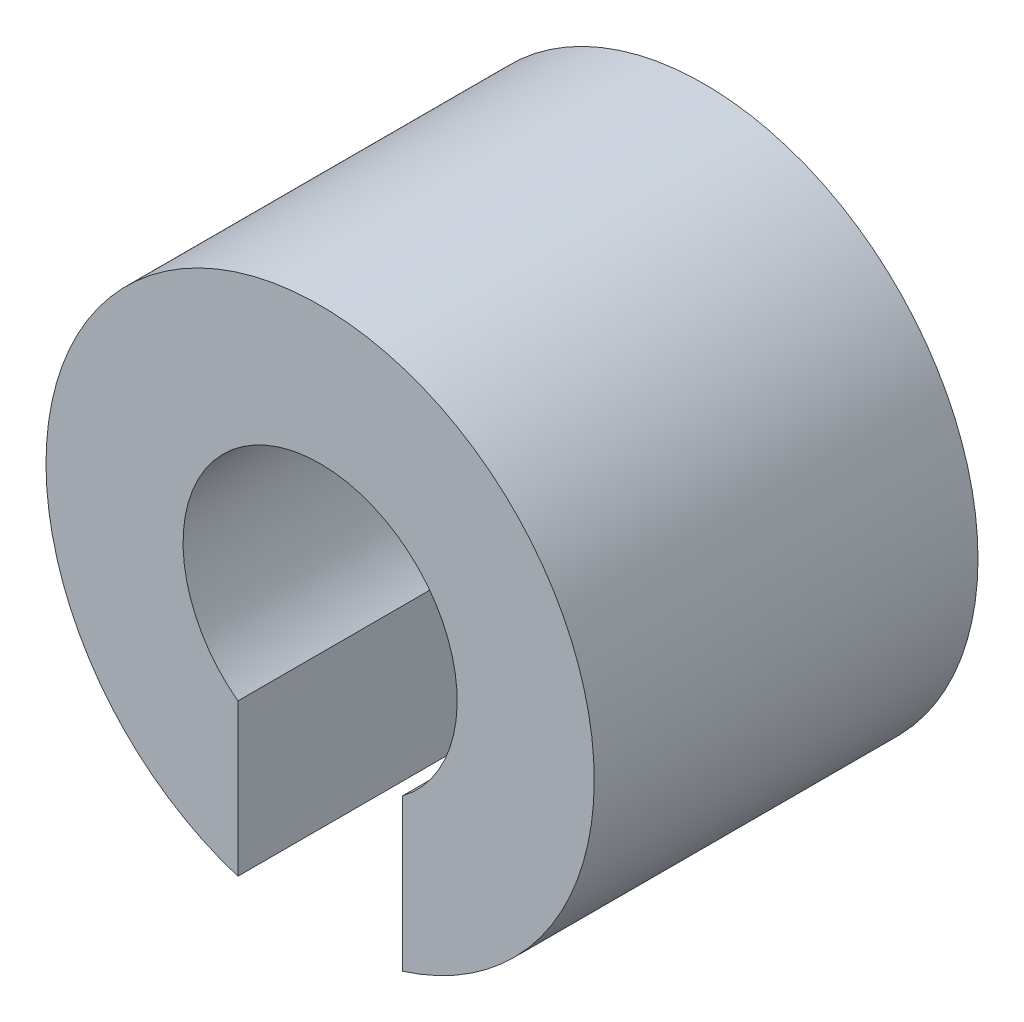
ISO-10303-21;
HEADER;
FILE_DESCRIPTION(('STEP AP214'),'2;1');
FILE_NAME('part.step','',(''),(''),'','','');
FILE_SCHEMA(('AUTOMOTIVE_DESIGN { 1 0 10303 214 1 1 1 1 }'));
ENDSEC;
DATA;
#1=APPLICATION_CONTEXT('core data for automotive mechanical design processes');
#2=APPLICATION_PROTOCOL_DEFINITION('international standard','automotive_design',2000,#1);
#3=PRODUCT_CONTEXT('',#1,'mechanical');
#4=PRODUCT('Part','Part','',(#3));
#5=PRODUCT_RELATED_PRODUCT_CATEGORY('part','',(#4));
#6=PRODUCT_DEFINITION_FORMATION('','',#4);
#7=PRODUCT_DEFINITION_CONTEXT('part definition',#1,'design');
#8=PRODUCT_DEFINITION('design','',#6,#7);
#9=PRODUCT_DEFINITION_SHAPE('','',#8);
#10=(LENGTH_UNIT() NAMED_UNIT(*) SI_UNIT(.MILLI.,.METRE.));
#11=(NAMED_UNIT(*) PLANE_ANGLE_UNIT() SI_UNIT($,.RADIAN.));
#12=(NAMED_UNIT(*) SI_UNIT($,.STERADIAN.) SOLID_ANGLE_UNIT());
#13=UNCERTAINTY_MEASURE_WITH_UNIT(LENGTH_MEASURE(1.E-05),#10,'distance_accuracy_value','');
#14=(GEOMETRIC_REPRESENTATION_CONTEXT(3) GLOBAL_UNCERTAINTY_ASSIGNED_CONTEXT((#13)) GLOBAL_UNIT_ASSIGNED_CONTEXT((#10,
#11,#12)) REPRESENTATION_CONTEXT('',''));
#15=CARTESIAN_POINT('',(0.,0.,0.));
#16=DIRECTION('',(0.,0.,1.));
#17=DIRECTION('',(1.,0.,0.));
#18=AXIS2_PLACEMENT_3D('',#15,#16,#17);
#19=CARTESIAN_POINT('',(0.,0.,7.));
#20=DIRECTION('',(0.,0.,-1.));
#21=DIRECTION('',(-1.,0.,0.));
#22=AXIS2_PLACEMENT_3D('',#19,#20,#21);
#23=CYLINDRICAL_SURFACE('',#22,5.);
#24=CARTESIAN_POINT('',(0.,0.,0.));
#25=DIRECTION('',(0.,0.,1.));
#26=DIRECTION('',(1.,0.,0.));
#27=AXIS2_PLACEMENT_3D('',#24,#25,#26);
#28=CIRCLE('',#27,5.);
#29=CARTESIAN_POINT('',(1.5,-4.76969600708473,0.));
#30=VERTEX_POINT('',#29);
#31=CARTESIAN_POINT('',(-1.5,-4.76969600708473,0.));
#32=VERTEX_POINT('',#31);
#33=EDGE_CURVE('E94',#30,#32,#28,.T.);
#34=ORIENTED_EDGE('',*,*,#33,.T.);
#35=DIRECTION('',(0.,0.,-1.));
#36=VECTOR('',#35,1.);
#37=CARTESIAN_POINT('',(-1.5,-4.76969600708473,7.));
#38=LINE('',#37,#36);
#39=CARTESIAN_POINT('',(-1.5,-4.76969600708473,7.));
#40=VERTEX_POINT('',#39);
#41=EDGE_CURVE('E11',#40,#32,#38,.T.);
#42=ORIENTED_EDGE('',*,*,#41,.F.);
#43=CARTESIAN_POINT('',(0.,0.,7.));
#44=DIRECTION('',(0.,0.,1.));
#45=DIRECTION('',(1.,0.,0.));
#46=AXIS2_PLACEMENT_3D('',#43,#44,#45);
#47=CIRCLE('',#46,5.);
#48=CARTESIAN_POINT('',(1.5,-4.76969600708473,7.));
#49=VERTEX_POINT('',#48);
#50=EDGE_CURVE('E82',#49,#40,#47,.T.);
#51=ORIENTED_EDGE('',*,*,#50,.F.);
#52=DIRECTION('',(0.,0.,-1.));
#53=VECTOR('',#52,1.);
#54=CARTESIAN_POINT('',(1.5,-4.76969600708473,7.));
#55=LINE('',#54,#53);
#56=EDGE_CURVE('E90',#49,#30,#55,.T.);
#57=ORIENTED_EDGE('',*,*,#56,.T.);
#58=EDGE_LOOP('',(#34,#42,#51,#57));
#59=FACE_BOUND('',#58,.T.);
#60=ADVANCED_FACE('F31',(#59),#23,.T.);
#61=CARTESIAN_POINT('',(-1.5,-4.76969600708473,7.));
#62=DIRECTION('',(-1.,0.,0.));
#63=DIRECTION('',(0.,-1.,0.));
#64=AXIS2_PLACEMENT_3D('',#61,#62,#63);
#65=PLANE('',#64);
#66=DIRECTION('',(0.,1.,0.));
#67=VECTOR('',#66,1.);
#68=CARTESIAN_POINT('',(-1.5,-4.76969600708473,0.));
#69=LINE('',#68,#67);
#70=CARTESIAN_POINT('',(-1.5,-2.,0.));
#71=VERTEX_POINT('',#70);
#72=EDGE_CURVE('E86',#32,#71,#69,.T.);
#73=ORIENTED_EDGE('',*,*,#72,.T.);
#74=DIRECTION('',(0.,0.,-1.));
#75=VECTOR('',#74,1.);
#76=CARTESIAN_POINT('',(-1.5,-2.,7.));
#77=LINE('',#76,#75);
#78=CARTESIAN_POINT('',(-1.5,-2.,7.));
#79=VERTEX_POINT('',#78);
#80=EDGE_CURVE('E39',#79,#71,#77,.T.);
#81=ORIENTED_EDGE('',*,*,#80,.F.);
#82=DIRECTION('',(0.,1.,0.));
#83=VECTOR('',#82,1.);
#84=CARTESIAN_POINT('',(-1.5,-4.76969600708473,7.));
#85=LINE('',#84,#83);
#86=EDGE_CURVE('E77',#40,#79,#85,.T.);
#87=ORIENTED_EDGE('',*,*,#86,.F.);
#88=ORIENTED_EDGE('',*,*,#41,.T.);
#89=EDGE_LOOP('',(#73,#81,#87,#88));
#90=FACE_BOUND('',#89,.T.);
#91=ADVANCED_FACE('F85',(#90),#65,.F.);
#92=CARTESIAN_POINT('',(0.,0.,7.));
#93=DIRECTION('',(0.,0.,-1.));
#94=DIRECTION('',(-1.,0.,0.));
#95=AXIS2_PLACEMENT_3D('',#92,#93,#94);
#96=CYLINDRICAL_SURFACE('',#95,2.5);
#97=CARTESIAN_POINT('',(0.,0.,0.));
#98=DIRECTION('',(0.,0.,-1.));
#99=DIRECTION('',(1.,0.,0.));
#100=AXIS2_PLACEMENT_3D('',#97,#98,#99);
#101=CIRCLE('',#100,2.5);
#102=CARTESIAN_POINT('',(1.5,-2.,0.));
#103=VERTEX_POINT('',#102);
#104=EDGE_CURVE('E64',#71,#103,#101,.T.);
#105=ORIENTED_EDGE('',*,*,#104,.T.);
#106=DIRECTION('',(0.,0.,-1.));
#107=VECTOR('',#106,1.);
#108=CARTESIAN_POINT('',(1.5,-2.,7.));
#109=LINE('',#108,#107);
#110=CARTESIAN_POINT('',(1.5,-2.,7.));
#111=VERTEX_POINT('',#110);
#112=EDGE_CURVE('E87',#111,#103,#109,.T.);
#113=ORIENTED_EDGE('',*,*,#112,.F.);
#114=CARTESIAN_POINT('',(0.,0.,7.));
#115=DIRECTION('',(0.,0.,-1.));
#116=DIRECTION('',(1.,0.,0.));
#117=AXIS2_PLACEMENT_3D('',#114,#115,#116);
#118=CIRCLE('',#117,2.5);
#119=EDGE_CURVE('E80',#79,#111,#118,.T.);
#120=ORIENTED_EDGE('',*,*,#119,.F.);
#121=ORIENTED_EDGE('',*,*,#80,.T.);
#122=EDGE_LOOP('',(#105,#113,#120,#121));
#123=FACE_BOUND('',#122,.T.);
#124=ADVANCED_FACE('F88',(#123),#96,.F.);
#125=CARTESIAN_POINT('',(1.5,-4.76969600708473,7.));
#126=DIRECTION('',(1.,0.,0.));
#127=DIRECTION('',(0.,1.,0.));
#128=AXIS2_PLACEMENT_3D('',#125,#126,#127);
#129=PLANE('',#128);
#130=DIRECTION('',(0.,-1.,0.));
#131=VECTOR('',#130,1.);
#132=CARTESIAN_POINT('',(1.5,-4.76969600708473,0.));
#133=LINE('',#132,#131);
#134=EDGE_CURVE('E70',#103,#30,#133,.T.);
#135=ORIENTED_EDGE('',*,*,#134,.T.);
#136=ORIENTED_EDGE('',*,*,#56,.F.);
#137=DIRECTION('',(0.,-1.,0.));
#138=VECTOR('',#137,1.);
#139=CARTESIAN_POINT('',(1.5,-4.76969600708473,7.));
#140=LINE('',#139,#138);
#141=EDGE_CURVE('E47',#111,#49,#140,.T.);
#142=ORIENTED_EDGE('',*,*,#141,.F.);
#143=ORIENTED_EDGE('',*,*,#112,.T.);
#144=EDGE_LOOP('',(#135,#136,#142,#143));
#145=FACE_BOUND('',#144,.T.);
#146=ADVANCED_FACE('F101',(#145),#129,.F.);
#147=CARTESIAN_POINT('',(0.,0.,7.));
#148=DIRECTION('',(0.,0.,1.));
#149=DIRECTION('',(1.,0.,0.));
#150=AXIS2_PLACEMENT_3D('',#147,#148,#149);
#151=PLANE('',#150);
#152=ORIENTED_EDGE('',*,*,#50,.T.);
#153=ORIENTED_EDGE('',*,*,#86,.T.);
#154=ORIENTED_EDGE('',*,*,#119,.T.);
#155=ORIENTED_EDGE('',*,*,#141,.T.);
#156=EDGE_LOOP('',(#152,#153,#154,#155));
#157=FACE_BOUND('',#156,.T.);
#158=ADVANCED_FACE('F78',(#157),#151,.T.);
#159=CARTESIAN_POINT('',(0.,0.,0.));
#160=DIRECTION('',(0.,0.,1.));
#161=DIRECTION('',(1.,0.,0.));
#162=AXIS2_PLACEMENT_3D('',#159,#160,#161);
#163=PLANE('',#162);
#164=ORIENTED_EDGE('',*,*,#33,.F.);
#165=ORIENTED_EDGE('',*,*,#134,.F.);
#166=ORIENTED_EDGE('',*,*,#104,.F.);
#167=ORIENTED_EDGE('',*,*,#72,.F.);
#168=EDGE_LOOP('',(#164,#165,#166,#167));
#169=FACE_BOUND('',#168,.T.);
#170=ADVANCED_FACE('F104',(#169),#163,.F.);
#171=CLOSED_SHELL('',(#60,#91,#124,#146,#158,#170));
#172=MANIFOLD_SOLID_BREP('B2',#171);
#173=ADVANCED_BREP_SHAPE_REPRESENTATION('',(#18,#172),#14);
#174=SHAPE_DEFINITION_REPRESENTATION(#9,#173);
ENDSEC;
END-ISO-10303-21;
